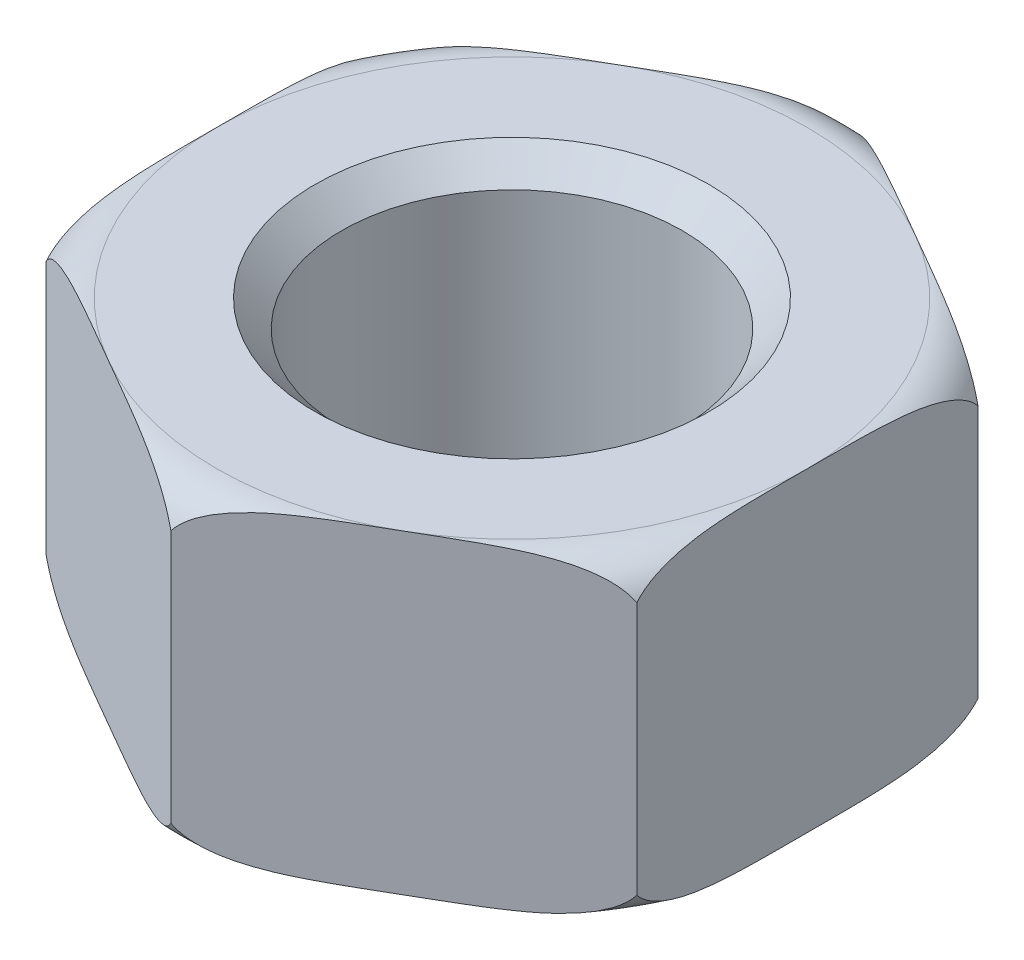
ISO-10303-21;
HEADER;
FILE_DESCRIPTION(('STEP AP214'),'2;1');
FILE_NAME('part.step','',(''),(''),'','','');
FILE_SCHEMA(('AUTOMOTIVE_DESIGN { 1 0 10303 214 1 1 1 1 }'));
ENDSEC;
DATA;
#1=APPLICATION_CONTEXT('core data for automotive mechanical design processes');
#2=APPLICATION_PROTOCOL_DEFINITION('international standard','automotive_design',2000,#1);
#3=PRODUCT_CONTEXT('',#1,'mechanical');
#4=PRODUCT('Part','Part','',(#3));
#5=PRODUCT_RELATED_PRODUCT_CATEGORY('part','',(#4));
#6=PRODUCT_DEFINITION_FORMATION('','',#4);
#7=PRODUCT_DEFINITION_CONTEXT('part definition',#1,'design');
#8=PRODUCT_DEFINITION('design','',#6,#7);
#9=PRODUCT_DEFINITION_SHAPE('','',#8);
#10=(LENGTH_UNIT() NAMED_UNIT(*) SI_UNIT(.MILLI.,.METRE.));
#11=(NAMED_UNIT(*) PLANE_ANGLE_UNIT() SI_UNIT($,.RADIAN.));
#12=(NAMED_UNIT(*) SI_UNIT($,.STERADIAN.) SOLID_ANGLE_UNIT());
#13=UNCERTAINTY_MEASURE_WITH_UNIT(LENGTH_MEASURE(1.E-05),#10,'distance_accuracy_value','');
#14=(GEOMETRIC_REPRESENTATION_CONTEXT(3) GLOBAL_UNCERTAINTY_ASSIGNED_CONTEXT((#13)) GLOBAL_UNIT_ASSIGNED_CONTEXT((#10,
#11,#12)) REPRESENTATION_CONTEXT('',''));
#15=CARTESIAN_POINT('',(0.,0.,0.));
#16=DIRECTION('',(0.,0.,1.));
#17=DIRECTION('',(1.,0.,0.));
#18=AXIS2_PLACEMENT_3D('',#15,#16,#17);
#19=CARTESIAN_POINT('',(0.,99.353,0.));
#20=DIRECTION('',(0.,-1.,0.));
#21=DIRECTION('',(0.,0.,-1.));
#22=AXIS2_PLACEMENT_3D('',#19,#20,#21);
#23=CONICAL_SURFACE('',#22,8.647,0.7853981634);
#24=CARTESIAN_POINT('',(0.,99.353,0.));
#25=DIRECTION('',(0.,-1.,0.));
#26=DIRECTION('',(0.,0.,-1.));
#27=AXIS2_PLACEMENT_3D('',#24,#25,#26);
#28=CIRCLE('',#27,8.647);
#29=CARTESIAN_POINT('',(0.,99.353,-8.647));
#30=VERTEX_POINT('',#29);
#31=EDGE_CURVE('E444',#30,#30,#28,.T.);
#32=ORIENTED_EDGE('',*,*,#31,.F.);
#33=EDGE_LOOP('',(#32));
#34=FACE_BOUND('',#33,.T.);
#35=CARTESIAN_POINT('',(0.,98.,0.));
#36=DIRECTION('',(0.,-1.,0.));
#37=DIRECTION('',(0.,0.,-1.));
#38=AXIS2_PLACEMENT_3D('',#35,#36,#37);
#39=CIRCLE('',#38,10.);
#40=CARTESIAN_POINT('',(0.,98.,-10.));
#41=VERTEX_POINT('',#40);
#42=EDGE_CURVE('E647',#41,#41,#39,.T.);
#43=ORIENTED_EDGE('',*,*,#42,.T.);
#44=EDGE_LOOP('',(#43));
#45=FACE_BOUND('',#44,.T.);
#46=ADVANCED_FACE('F16',(#34,#45),#23,.F.);
#47=CARTESIAN_POINT('',(0.,100.5,0.));
#48=DIRECTION('',(0.,-1.,0.));
#49=DIRECTION('',(0.,0.,-1.));
#50=AXIS2_PLACEMENT_3D('',#47,#48,#49);
#51=TOROIDAL_SURFACE('',#50,15.,2.5);
#52=CARTESIAN_POINT('',(0.,98.,0.));
#53=DIRECTION('',(0.,-1.,0.));
#54=DIRECTION('',(0.,0.,-1.));
#55=AXIS2_PLACEMENT_3D('',#52,#53,#54);
#56=CIRCLE('',#55,15.);
#57=CARTESIAN_POINT('',(15.,98.,0.));
#58=VERTEX_POINT('',#57);
#59=CARTESIAN_POINT('',(7.5,98.,12.9903810567666));
#60=VERTEX_POINT('',#59);
#61=EDGE_CURVE('E642',#58,#60,#56,.T.);
#62=ORIENTED_EDGE('',*,*,#61,.F.);
#63=CARTESIAN_POINT('',(15.,99.5698160017164,8.6602540378445));
#64=CARTESIAN_POINT('',(15.,99.1235587743943,8.30248641245072));
#65=CARTESIAN_POINT('',(15.,98.7969868193529,7.63259410784461));
#66=CARTESIAN_POINT('',(15.,98.5436425127163,7.11291261403682));
#67=CARTESIAN_POINT('',(15.,98.3732258924549,6.41584851672687));
#68=CARTESIAN_POINT('',(15.,98.1765293572079,5.6112902959642));
#69=CARTESIAN_POINT('',(15.,98.0891008871725,4.50357468180948));
#70=CARTESIAN_POINT('',(15.,98.0193801516706,3.62021543607928));
#71=CARTESIAN_POINT('',(15.,98.0056706848194,2.25321956097453));
#72=CARTESIAN_POINT('',(15.,97.9999999999998,1.68778526352565));
#73=CARTESIAN_POINT('',(15.,97.9999999999998,0.));
#74=B_SPLINE_CURVE_WITH_KNOTS('',2,(#63,#64,#65,#66,#67,#68,#69,#70,#71,#72,#73),.UNSPECIFIED.,
.F.,.F.,(3,2,2,2,2,3),(0.,0.142857142857143,0.285714285714286,0.5,0.75,1.),.UNSPECIFIED.);
#75=CARTESIAN_POINT('',(15.,99.5698160017164,8.6602540378445));
#76=VERTEX_POINT('',#75);
#77=EDGE_CURVE('E28',#76,#58,#74,.T.);
#78=ORIENTED_EDGE('',*,*,#77,.F.);
#79=CARTESIAN_POINT('',(7.50000000000001,98.,12.9903810567666));
#80=CARTESIAN_POINT('',(8.96130139296698,98.,12.14669830417));
#81=CARTESIAN_POINT('',(9.45168874238305,98.0056746595264,11.8635730359774));
#82=CARTESIAN_POINT('',(10.6339885104924,98.0193559844018,11.1809719465966));
#83=CARTESIAN_POINT('',(11.3995414098782,98.0890399843953,10.7389797740573));
#84=CARTESIAN_POINT('',(12.7132104172627,98.2086159290171,9.98053261901784));
#85=CARTESIAN_POINT('',(13.580530579708,98.5478938005466,9.47978508975645));
#86=CARTESIAN_POINT('',(14.0128615715186,98.7170128237735,9.23017867525555));
#87=CARTESIAN_POINT('',(14.3513386318172,98.9459349697346,9.03475885337765));
#88=CARTESIAN_POINT('',(14.7576194955756,99.2207148532293,8.80019248732015));
#89=CARTESIAN_POINT('',(14.9999999999954,99.5698160017096,8.66025403784707));
#90=B_SPLINE_CURVE_WITH_KNOTS('',2,(#79,#80,#81,#82,#83,#84,#85,#86,#87,#88,#89),.UNSPECIFIED.,
.F.,.F.,(3,2,2,2,2,3),(0.,0.25,0.5,0.785714285714286,0.892857142857143,1.),.UNSPECIFIED.);
#91=EDGE_CURVE('E274',#60,#76,#90,.T.);
#92=ORIENTED_EDGE('',*,*,#91,.F.);
#93=EDGE_LOOP('',(#62,#78,#92));
#94=FACE_BOUND('',#93,.T.);
#95=ADVANCED_FACE('F329',(#94),#51,.T.);
#96=CARTESIAN_POINT('',(0.,100.5,0.));
#97=DIRECTION('',(0.,-1.,0.));
#98=DIRECTION('',(0.,0.,-1.));
#99=AXIS2_PLACEMENT_3D('',#96,#97,#98);
#100=TOROIDAL_SURFACE('',#99,15.,2.5);
#101=CARTESIAN_POINT('',(0.,98.,0.));
#102=DIRECTION('',(0.,-1.,0.));
#103=DIRECTION('',(0.,0.,-1.));
#104=AXIS2_PLACEMENT_3D('',#101,#102,#103);
#105=CIRCLE('',#104,15.);
#106=CARTESIAN_POINT('',(7.5,98.,-12.9903810567666));
#107=VERTEX_POINT('',#106);
#108=EDGE_CURVE('E638',#107,#58,#105,.T.);
#109=ORIENTED_EDGE('',*,*,#108,.F.);
#110=CARTESIAN_POINT('',(15.,99.5698160017162,-8.66025403784439));
#111=CARTESIAN_POINT('',(14.6901583945827,99.1235504880852,-8.83914117213819));
#112=CARTESIAN_POINT('',(14.1070099075446,98.7951777401203,-9.17582210810721));
#113=CARTESIAN_POINT('',(13.6560550351045,98.5412436324912,-9.43618102510283));
#114=CARTESIAN_POINT('',(13.0496927853532,98.3715958813944,-9.78626443322316));
#115=CARTESIAN_POINT('',(12.3469398749741,98.1749799956406,-10.1919990152044));
#116=CARTESIAN_POINT('',(11.3942245112058,98.088556842543,-10.7420494869371));
#117=CARTESIAN_POINT('',(10.9487787627853,98.0481493634821,-10.999227709697));
#118=CARTESIAN_POINT('',(10.4228436589616,98.0279250351167,-11.3028764834659));
#119=CARTESIAN_POINT('',(10.0125896437003,98.0121491117042,-11.5397367496132));
#120=CARTESIAN_POINT('',(9.44929207325011,98.0056469594591,-11.8649567535464));
#121=CARTESIAN_POINT('',(9.15200076880457,98.0022153215043,-12.0365979681958));
#122=CARTESIAN_POINT('',(8.79968794252099,98.0008530140581,-12.2400058732896));
#123=CARTESIAN_POINT('',(8.57908590843888,98.,-12.3673705170507));
#124=CARTESIAN_POINT('',(7.49999999999998,98.,-12.9903810567666));
#125=B_SPLINE_CURVE_WITH_KNOTS('',2,(#110,#111,#112,#113,#114,#115,#116,#117,#118,#119,#120,
#121,#122,#123,#124),.UNSPECIFIED.,.F.,.F.,(3,2,2,2,2,2,2,3),(0.,0.142857142857143,
0.285714285714286,0.5,0.625,0.75,0.833333333333333,1.),.UNSPECIFIED.);
#126=CARTESIAN_POINT('',(15.,99.5698160017162,-8.66025403784439));
#127=VERTEX_POINT('',#126);
#128=EDGE_CURVE('E590',#127,#107,#125,.T.);
#129=ORIENTED_EDGE('',*,*,#128,.F.);
#130=CARTESIAN_POINT('',(15.,97.9999999999998,0.));
#131=CARTESIAN_POINT('',(15.,97.9999999999998,-1.68868131386039));
#132=CARTESIAN_POINT('',(15.,98.0056922792719,-2.25537113221989));
#133=CARTESIAN_POINT('',(15.,98.0122399374035,-2.90721743489511));
#134=CARTESIAN_POINT('',(15.,98.0281568381506,-3.38252569359753));
#135=CARTESIAN_POINT('',(15.,98.0485310932759,-3.99093884386311));
#136=CARTESIAN_POINT('',(15.,98.0895002561107,-4.50862793481097));
#137=CARTESIAN_POINT('',(15.,98.1449823104225,-5.20970289639727));
#138=CARTESIAN_POINT('',(15.,98.2444066186536,-5.78851901899739));
#139=CARTESIAN_POINT('',(15.,98.3632900476595,-6.48061984064661));
#140=CARTESIAN_POINT('',(15.,98.5522744124461,-7.03388595719446));
#141=CARTESIAN_POINT('',(15.,98.7226635616629,-7.53271316438461));
#142=CARTESIAN_POINT('',(15.,98.9499261318429,-7.91781339707681));
#143=CARTESIAN_POINT('',(15.,99.2248677171825,-8.38370651976381));
#144=CARTESIAN_POINT('',(15.,99.5698160017162,-8.66025403784441));
#145=B_SPLINE_CURVE_WITH_KNOTS('',2,(#130,#131,#132,#133,#134,#135,#136,#137,#138,#139,#140,
#141,#142,#143,#144),.UNSPECIFIED.,.F.,.F.,(3,2,2,2,2,2,2,3),(0.,0.25,0.375,0.5,
0.642857142857143,0.785714285714286,0.892857142857143,1.),.UNSPECIFIED.);
#146=EDGE_CURVE('E11',#58,#127,#145,.T.);
#147=ORIENTED_EDGE('',*,*,#146,.F.);
#148=EDGE_LOOP('',(#109,#129,#147));
#149=FACE_BOUND('',#148,.T.);
#150=ADVANCED_FACE('F294',(#149),#100,.T.);
#151=CARTESIAN_POINT('',(15.,98.,8.66025403784439));
#152=DIRECTION('',(1.,0.,0.));
#153=DIRECTION('',(0.,1.,0.));
#154=AXIS2_PLACEMENT_3D('',#151,#152,#153);
#155=PLANE('',#154);
#156=CARTESIAN_POINT('',(15.,112.430183998289,-8.66025403784011));
#157=CARTESIAN_POINT('',(15.,112.876441225636,-8.30248641242526));
#158=CARTESIAN_POINT('',(15.,113.20301318065,-7.63259410783921));
#159=CARTESIAN_POINT('',(15.,113.456357487343,-7.11291261388786));
#160=CARTESIAN_POINT('',(15.,113.626774107546,-6.41584851672201));
#161=CARTESIAN_POINT('',(15.,113.823470642816,-5.61129029575693));
#162=CARTESIAN_POINT('',(15.,113.910899112828,-4.50357468180603));
#163=CARTESIAN_POINT('',(15.,113.980619848316,-3.62021543618047));
#164=CARTESIAN_POINT('',(15.,113.994329315181,-2.25321956097283));
#165=CARTESIAN_POINT('',(15.,114.,-1.68778526407481));
#166=CARTESIAN_POINT('',(15.,114.,0.));
#167=B_SPLINE_CURVE_WITH_KNOTS('',2,(#156,#157,#158,#159,#160,#161,#162,#163,#164,#165,#166),
.UNSPECIFIED.,.F.,.F.,(3,2,2,2,2,3),(0.,0.142857142857143,0.285714285714286,0.5,0.75,1.),.UNSPECIFIED.);
#168=CARTESIAN_POINT('',(14.9999999999908,112.430183998297,-8.66025403784971));
#169=VERTEX_POINT('',#168);
#170=CARTESIAN_POINT('',(15.,114.,0.));
#171=VERTEX_POINT('',#170);
#172=EDGE_CURVE('E449',#169,#171,#167,.T.);
#173=ORIENTED_EDGE('',*,*,#172,.T.);
#174=CARTESIAN_POINT('',(15.,114.,0.));
#175=CARTESIAN_POINT('',(15.,114.,1.68868131354634));
#176=CARTESIAN_POINT('',(15.,113.994307720728,2.2553711322199));
#177=CARTESIAN_POINT('',(15.,113.9877600626,2.90721743494813));
#178=CARTESIAN_POINT('',(15.,113.971843161849,3.38252569359754));
#179=CARTESIAN_POINT('',(15.,113.951468906711,3.99093884405182));
#180=CARTESIAN_POINT('',(15.,113.910499743889,4.508627934811));
#181=CARTESIAN_POINT('',(15.,113.855017689591,5.20970289619395));
#182=CARTESIAN_POINT('',(15.,113.755593381346,5.78851901899741));
#183=CARTESIAN_POINT('',(15.,113.636709952394,6.48061984047995));
#184=CARTESIAN_POINT('',(15.,113.447725587554,7.03388595719449));
#185=CARTESIAN_POINT('',(15.,113.277336438343,7.53271316437491));
#186=CARTESIAN_POINT('',(15.,113.050073868157,7.9178133970768));
#187=CARTESIAN_POINT('',(15.,112.775132282818,8.3837065197623));
#188=CARTESIAN_POINT('',(15.,112.430183998284,8.66025403784439));
#189=B_SPLINE_CURVE_WITH_KNOTS('',2,(#174,#175,#176,#177,#178,#179,#180,#181,#182,#183,#184,
#185,#186,#187,#188),.UNSPECIFIED.,.F.,.F.,(3,2,2,2,2,2,2,3),(0.,0.25,0.375,0.5,
0.642857142857143,0.785714285714286,0.892857142857143,1.),.UNSPECIFIED.);
#190=CARTESIAN_POINT('',(15.,112.430183998284,8.66025403784439));
#191=VERTEX_POINT('',#190);
#192=EDGE_CURVE('E137',#171,#191,#189,.T.);
#193=ORIENTED_EDGE('',*,*,#192,.T.);
#194=DIRECTION('',(0.,1.,0.));
#195=VECTOR('',#194,1.);
#196=CARTESIAN_POINT('',(15.,98.,8.66025403784439));
#197=LINE('',#196,#195);
#198=EDGE_CURVE('E327',#76,#191,#197,.T.);
#199=ORIENTED_EDGE('',*,*,#198,.F.);
#200=ORIENTED_EDGE('',*,*,#77,.T.);
#201=ORIENTED_EDGE('',*,*,#146,.T.);
#202=DIRECTION('',(0.,1.,0.));
#203=VECTOR('',#202,1.);
#204=CARTESIAN_POINT('',(15.,98.,-8.66025403784439));
#205=LINE('',#204,#203);
#206=EDGE_CURVE('E624',#127,#169,#205,.T.);
#207=ORIENTED_EDGE('',*,*,#206,.T.);
#208=EDGE_LOOP('',(#173,#193,#199,#200,#201,#207));
#209=FACE_BOUND('',#208,.T.);
#210=ADVANCED_FACE('F284',(#209),#155,.T.);
#211=CARTESIAN_POINT('',(-15.,98.,8.66025403784439));
#212=DIRECTION('',(-0.5,0.,0.866025403784439));
#213=DIRECTION('',(0.,1.,0.));
#214=AXIS2_PLACEMENT_3D('',#211,#212,#213);
#215=PLANE('',#214);
#216=DIRECTION('',(0.,1.,0.));
#217=VECTOR('',#216,1.);
#218=CARTESIAN_POINT('',(0.,98.,17.3205080756888));
#219=LINE('',#218,#217);
#220=CARTESIAN_POINT('',(0.,99.5698160017011,17.3205080756827));
#221=VERTEX_POINT('',#220);
#222=CARTESIAN_POINT('',(0.,112.430183998297,17.3205080756834));
#223=VERTEX_POINT('',#222);
#224=EDGE_CURVE('E694',#221,#223,#219,.T.);
#225=ORIENTED_EDGE('',*,*,#224,.T.);
#226=CARTESIAN_POINT('',(-2.43728648374741E-12,112.430183998298,17.3205080756874));
#227=CARTESIAN_POINT('',(-0.309841605470358,112.876449511963,17.1416209413643));
#228=CARTESIAN_POINT('',(-0.892990092455252,113.20482225988,16.8049400054261));
#229=CARTESIAN_POINT('',(-1.34394496492118,113.458756367509,16.5445810884155));
#230=CARTESIAN_POINT('',(-1.95030721464656,113.628404118606,16.1944976803101));
#231=CARTESIAN_POINT('',(-2.65306012499316,113.825020004358,15.7887630983477));
#232=CARTESIAN_POINT('',(-3.60577548879402,113.911443157457,15.2387126265962));
#233=CARTESIAN_POINT('',(-4.05122123721179,113.951850636517,14.9815344038378));
#234=CARTESIAN_POINT('',(-4.57715634103828,113.972074964883,14.6778856300673));
#235=CARTESIAN_POINT('',(-4.98741035668797,113.987850888312,14.4410253636959));
#236=CARTESIAN_POINT('',(-5.55070792674983,113.994353040541,14.1158053599868));
#237=CARTESIAN_POINT('',(-5.84799923200435,113.9977846785,13.9441641448703));
#238=CARTESIAN_POINT('',(-6.20031205747897,113.999146985942,13.7407562402436));
#239=CARTESIAN_POINT('',(-6.42091409158262,114.,13.6133915964701));
#240=CARTESIAN_POINT('',(-7.49999999999998,114.,12.9903810567666));
#241=B_SPLINE_CURVE_WITH_KNOTS('',2,(#226,#227,#228,#229,#230,#231,#232,#233,#234,#235,#236,
#237,#238,#239,#240),.UNSPECIFIED.,.F.,.F.,(3,2,2,2,2,2,2,3),(0.,0.142857142857143,
0.285714285714286,0.5,0.625,0.75,0.833333333333333,1.),.UNSPECIFIED.);
#242=CARTESIAN_POINT('',(-7.5,114.,12.9903810567666));
#243=VERTEX_POINT('',#242);
#244=EDGE_CURVE('E656',#223,#243,#241,.T.);
#245=ORIENTED_EDGE('',*,*,#244,.T.);
#246=CARTESIAN_POINT('',(-7.49999999999998,114.,12.9903810567666));
#247=CARTESIAN_POINT('',(-8.96130139124323,114.,12.1466983051651));
#248=CARTESIAN_POINT('',(-9.45168874238303,113.994325340474,11.8635730359774));
#249=CARTESIAN_POINT('',(-10.6339885096989,113.980644015655,11.1809719470547));
#250=CARTESIAN_POINT('',(-11.3995414098781,113.910960015605,10.7389797740574));
#251=CARTESIAN_POINT('',(-12.7132104170932,113.791384071025,9.98053261911569));
#252=CARTESIAN_POINT('',(-13.5805305797077,113.452106199454,9.47978508975659));
#253=CARTESIAN_POINT('',(-14.0128615714777,113.282987176255,9.23017867527915));
#254=CARTESIAN_POINT('',(-14.3513386318171,113.054065030265,9.03475885337769));
#255=CARTESIAN_POINT('',(-14.7576194955772,112.779285146768,8.80019248731921));
#256=CARTESIAN_POINT('',(-14.9999999999954,112.43018399829,8.66025403784705));
#257=B_SPLINE_CURVE_WITH_KNOTS('',2,(#246,#247,#248,#249,#250,#251,#252,#253,#254,#255,#256),
.UNSPECIFIED.,.F.,.F.,(3,2,2,2,2,3),(0.,0.25,0.5,0.785714285714286,0.892857142857143,1.),.UNSPECIFIED.);
#258=CARTESIAN_POINT('',(-15.,112.430183998284,8.6602540378445));
#259=VERTEX_POINT('',#258);
#260=EDGE_CURVE('E721',#243,#259,#257,.T.);
#261=ORIENTED_EDGE('',*,*,#260,.T.);
#262=DIRECTION('',(0.,1.,0.));
#263=VECTOR('',#262,1.);
#264=CARTESIAN_POINT('',(-15.,98.,8.66025403784439));
#265=LINE('',#264,#263);
#266=CARTESIAN_POINT('',(-15.,99.5698160017162,8.66025403784439));
#267=VERTEX_POINT('',#266);
#268=EDGE_CURVE('E41',#267,#259,#265,.T.);
#269=ORIENTED_EDGE('',*,*,#268,.F.);
#270=CARTESIAN_POINT('',(-15.,99.5698160017162,8.66025403784439));
#271=CARTESIAN_POINT('',(-14.6901583945827,99.1235504880852,8.83914117213819));
#272=CARTESIAN_POINT('',(-14.1070099075446,98.7951777401203,9.17582210810721));
#273=CARTESIAN_POINT('',(-13.6560550351045,98.5412436324912,9.43618102510283));
#274=CARTESIAN_POINT('',(-13.0496927853532,98.3715958813944,9.78626443322316));
#275=CARTESIAN_POINT('',(-12.3469398749741,98.1749799956406,10.1919990152044));
#276=CARTESIAN_POINT('',(-11.3942245112058,98.088556842543,10.7420494869371));
#277=CARTESIAN_POINT('',(-10.9487787627853,98.0481493634821,10.999227709697));
#278=CARTESIAN_POINT('',(-10.4228436589616,98.0279250351167,11.3028764834659));
#279=CARTESIAN_POINT('',(-10.0125896437003,98.0121491117042,11.5397367496132));
#280=CARTESIAN_POINT('',(-9.44929207325011,98.0056469594591,11.8649567535464));
#281=CARTESIAN_POINT('',(-9.15200076880457,98.0022153215043,12.0365979681958));
#282=CARTESIAN_POINT('',(-8.79968794252099,98.0008530140581,12.2400058732896));
#283=CARTESIAN_POINT('',(-8.57908590843888,98.,12.3673705170507));
#284=CARTESIAN_POINT('',(-7.49999999999998,98.,12.9903810567666));
#285=B_SPLINE_CURVE_WITH_KNOTS('',2,(#270,#271,#272,#273,#274,#275,#276,#277,#278,#279,#280,
#281,#282,#283,#284),.UNSPECIFIED.,.F.,.F.,(3,2,2,2,2,2,2,3),(0.,0.142857142857143,
0.285714285714286,0.5,0.625,0.75,0.833333333333333,1.),.UNSPECIFIED.);
#286=CARTESIAN_POINT('',(-7.5,98.,12.9903810567666));
#287=VERTEX_POINT('',#286);
#288=EDGE_CURVE('E763',#267,#287,#285,.T.);
#289=ORIENTED_EDGE('',*,*,#288,.T.);
#290=CARTESIAN_POINT('',(-7.49999999999998,98.,12.9903810567666));
#291=CARTESIAN_POINT('',(-6.0386986094978,98.,13.8340638079402));
#292=CARTESIAN_POINT('',(-5.54831125761696,98.0056746595264,14.1171890775558));
#293=CARTESIAN_POINT('',(-4.36601149039713,98.0193559843226,14.799790166423));
#294=CARTESIAN_POINT('',(-3.60045859012182,98.0890399843953,15.2417823394758));
#295=CARTESIAN_POINT('',(-2.28678958269993,98.2086159290174,16.0002294945369));
#296=CARTESIAN_POINT('',(-1.41946942029201,98.5478938005466,16.5009770237767));
#297=CARTESIAN_POINT('',(-0.987138428419907,98.7170128238047,16.7505834383131));
#298=CARTESIAN_POINT('',(-0.648661368182686,98.9459349697346,16.9460032601556));
#299=CARTESIAN_POINT('',(-0.242380504409223,99.2207148532521,17.1805696262218));
#300=CARTESIAN_POINT('',(-1.13971332371676E-12,99.5698160017095,17.3205080756881));
#301=B_SPLINE_CURVE_WITH_KNOTS('',2,(#290,#291,#292,#293,#294,#295,#296,#297,#298,#299,#300),
.UNSPECIFIED.,.F.,.F.,(3,2,2,2,2,3),(0.,0.25,0.5,0.785714285714286,0.892857142857143,1.),.UNSPECIFIED.);
#302=EDGE_CURVE('E756',#287,#221,#301,.T.);
#303=ORIENTED_EDGE('',*,*,#302,.T.);
#304=EDGE_LOOP('',(#225,#245,#261,#269,#289,#303));
#305=FACE_BOUND('',#304,.T.);
#306=ADVANCED_FACE('F216',(#305),#215,.T.);
#307=CARTESIAN_POINT('',(0.,111.5,0.));
#308=DIRECTION('',(0.,-1.,0.));
#309=DIRECTION('',(0.,0.,-1.));
#310=AXIS2_PLACEMENT_3D('',#307,#308,#309);
#311=TOROIDAL_SURFACE('',#310,15.,2.5);
#312=CARTESIAN_POINT('',(7.50000000000001,114.,12.9903810567666));
#313=CARTESIAN_POINT('',(6.03869860939971,114.,13.8340638079969));
#314=CARTESIAN_POINT('',(5.5483112576169,113.994325340474,14.1171890775559));
#315=CARTESIAN_POINT('',(4.36601149001812,113.98064401567,14.7997901666418));
#316=CARTESIAN_POINT('',(3.60045859012163,113.910960015605,15.241782339476));
#317=CARTESIAN_POINT('',(2.28678958258453,113.791384070926,16.0002294946036));
#318=CARTESIAN_POINT('',(1.419469420292,113.452106199453,16.5009770237768));
#319=CARTESIAN_POINT('',(0.987138428454884,113.282987176215,16.7505834382929));
#320=CARTESIAN_POINT('',(0.648661368182735,113.054065030265,16.9460032601556));
#321=CARTESIAN_POINT('',(0.242380504416437,112.779285146758,17.1805696262177));
#322=CARTESIAN_POINT('',(1.17067865106593E-12,112.43018399829,17.3205080756881));
#323=B_SPLINE_CURVE_WITH_KNOTS('',2,(#312,#313,#314,#315,#316,#317,#318,#319,#320,#321,#322),
.UNSPECIFIED.,.F.,.F.,(3,2,2,2,2,3),(0.,0.25,0.5,0.785714285714286,0.892857142857143,1.),.UNSPECIFIED.);
#324=CARTESIAN_POINT('',(7.5,114.,12.9903810567666));
#325=VERTEX_POINT('',#324);
#326=EDGE_CURVE('E391',#325,#223,#323,.T.);
#327=ORIENTED_EDGE('',*,*,#326,.F.);
#328=CARTESIAN_POINT('',(0.,114.,0.));
#329=DIRECTION('',(0.,-1.,0.));
#330=DIRECTION('',(0.,0.,-1.));
#331=AXIS2_PLACEMENT_3D('',#328,#329,#330);
#332=CIRCLE('',#331,15.);
#333=EDGE_CURVE('E508',#325,#243,#332,.T.);
#334=ORIENTED_EDGE('',*,*,#333,.T.);
#335=ORIENTED_EDGE('',*,*,#244,.F.);
#336=EDGE_LOOP('',(#327,#334,#335));
#337=FACE_BOUND('',#336,.T.);
#338=ADVANCED_FACE('F213',(#337),#311,.T.);
#339=CARTESIAN_POINT('',(-15.,98.,-8.66025403784439));
#340=DIRECTION('',(-1.,0.,0.));
#341=DIRECTION('',(0.,0.,1.));
#342=AXIS2_PLACEMENT_3D('',#339,#340,#341);
#343=PLANE('',#342);
#344=CARTESIAN_POINT('',(-15.,112.430183998284,8.66025403784451));
#345=CARTESIAN_POINT('',(-15.,112.876441225621,8.30248641243866));
#346=CARTESIAN_POINT('',(-15.,113.203013180647,7.63259410784461));
#347=CARTESIAN_POINT('',(-15.,113.456357487352,7.11291261388276));
#348=CARTESIAN_POINT('',(-15.,113.626774107545,6.41584851672686));
#349=CARTESIAN_POINT('',(-15.,113.823470642774,5.61129029589633));
#350=CARTESIAN_POINT('',(-15.,113.910899112828,4.50357468180951));
#351=CARTESIAN_POINT('',(-15.,113.980619848309,3.62021543657369));
#352=CARTESIAN_POINT('',(-15.,113.994329315181,2.25321956097459));
#353=CARTESIAN_POINT('',(-15.,114.,1.68778526419175));
#354=CARTESIAN_POINT('',(-15.,114.,0.));
#355=B_SPLINE_CURVE_WITH_KNOTS('',2,(#344,#345,#346,#347,#348,#349,#350,#351,#352,#353,#354),
.UNSPECIFIED.,.F.,.F.,(3,2,2,2,2,3),(0.,0.142857142857143,0.285714285714286,0.5,0.75,1.),.UNSPECIFIED.);
#356=CARTESIAN_POINT('',(-15.,114.,0.));
#357=VERTEX_POINT('',#356);
#358=EDGE_CURVE('E146',#259,#357,#355,.T.);
#359=ORIENTED_EDGE('',*,*,#358,.T.);
#360=CARTESIAN_POINT('',(-15.,114.,0.));
#361=CARTESIAN_POINT('',(-15.,114.,-1.68868131354634));
#362=CARTESIAN_POINT('',(-15.,113.994307720728,-2.2553711322199));
#363=CARTESIAN_POINT('',(-15.,113.9877600626,-2.90721743494813));
#364=CARTESIAN_POINT('',(-15.,113.971843161849,-3.38252569359754));
#365=CARTESIAN_POINT('',(-15.,113.951468906711,-3.99093884405182));
#366=CARTESIAN_POINT('',(-15.,113.910499743889,-4.508627934811));
#367=CARTESIAN_POINT('',(-15.,113.855017689591,-5.20970289619395));
#368=CARTESIAN_POINT('',(-15.,113.755593381346,-5.78851901899741));
#369=CARTESIAN_POINT('',(-15.,113.636709952394,-6.48061984047995));
#370=CARTESIAN_POINT('',(-15.,113.447725587554,-7.03388595719449));
#371=CARTESIAN_POINT('',(-15.,113.277336438343,-7.53271316437491));
#372=CARTESIAN_POINT('',(-15.,113.050073868157,-7.9178133970768));
#373=CARTESIAN_POINT('',(-15.,112.775132282818,-8.3837065197623));
#374=CARTESIAN_POINT('',(-15.,112.430183998284,-8.66025403784439));
#375=B_SPLINE_CURVE_WITH_KNOTS('',2,(#360,#361,#362,#363,#364,#365,#366,#367,#368,#369,#370,
#371,#372,#373,#374),.UNSPECIFIED.,.F.,.F.,(3,2,2,2,2,2,2,3),(0.,0.25,0.375,0.5,
0.642857142857143,0.785714285714286,0.892857142857143,1.),.UNSPECIFIED.);
#376=CARTESIAN_POINT('',(-15.,112.430183998284,-8.66025403784439));
#377=VERTEX_POINT('',#376);
#378=EDGE_CURVE('E518',#357,#377,#375,.T.);
#379=ORIENTED_EDGE('',*,*,#378,.T.);
#380=DIRECTION('',(0.,1.,0.));
#381=VECTOR('',#380,1.);
#382=CARTESIAN_POINT('',(-15.,98.,-8.66025403784439));
#383=LINE('',#382,#381);
#384=CARTESIAN_POINT('',(-15.,99.5698160017029,-8.66025403784439));
#385=VERTEX_POINT('',#384);
#386=EDGE_CURVE('E266',#385,#377,#383,.T.);
#387=ORIENTED_EDGE('',*,*,#386,.F.);
#388=CARTESIAN_POINT('',(-15.,99.5698160017082,-8.66025403783798));
#389=CARTESIAN_POINT('',(-15.,99.1235587743769,-8.30248641243266));
#390=CARTESIAN_POINT('',(-15.,98.796986819349,-7.63259410783657));
#391=CARTESIAN_POINT('',(-15.,98.5436425126597,-7.11291261390711));
#392=CARTESIAN_POINT('',(-15.,98.3732258924531,-6.41584851671968));
#393=CARTESIAN_POINT('',(-15.,98.1765293571752,-5.61129029571337));
#394=CARTESIAN_POINT('',(-15.,98.0891008871722,-4.50357468180434));
#395=CARTESIAN_POINT('',(-15.,98.0193801516873,-3.62021543615927));
#396=CARTESIAN_POINT('',(-15.,98.0056706848194,-2.25321956097197));
#397=CARTESIAN_POINT('',(-15.,97.9999999999998,-1.68778526418426));
#398=CARTESIAN_POINT('',(-15.,97.9999999999998,0.));
#399=B_SPLINE_CURVE_WITH_KNOTS('',2,(#388,#389,#390,#391,#392,#393,#394,#395,#396,#397,#398),
.UNSPECIFIED.,.F.,.F.,(3,2,2,2,2,3),(0.,0.142857142857143,0.285714285714286,0.5,0.75,1.),.UNSPECIFIED.);
#400=CARTESIAN_POINT('',(-15.,98.,0.));
#401=VERTEX_POINT('',#400);
#402=EDGE_CURVE('E549',#385,#401,#399,.T.);
#403=ORIENTED_EDGE('',*,*,#402,.T.);
#404=CARTESIAN_POINT('',(-15.,97.9999999999998,0.));
#405=CARTESIAN_POINT('',(-15.,97.9999999999998,1.68868131457895));
#406=CARTESIAN_POINT('',(-15.,98.0056922792719,2.25537113221989));
#407=CARTESIAN_POINT('',(-15.,98.0122399374231,2.90721743601945));
#408=CARTESIAN_POINT('',(-15.,98.0281568381506,3.38252569359753));
#409=CARTESIAN_POINT('',(-15.,98.0485310933162,3.99093884437157));
#410=CARTESIAN_POINT('',(-15.,98.0895002561107,4.50862793481097));
#411=CARTESIAN_POINT('',(-15.,98.1449823104225,5.20970289639727));
#412=CARTESIAN_POINT('',(-15.,98.2444066186536,5.78851901899739));
#413=CARTESIAN_POINT('',(-15.,98.3632900476595,6.48061984064661));
#414=CARTESIAN_POINT('',(-15.,98.5522744124461,7.03388595719446));
#415=CARTESIAN_POINT('',(-15.,98.7226635616629,7.53271316438461));
#416=CARTESIAN_POINT('',(-15.,98.9499261318429,7.91781339707681));
#417=CARTESIAN_POINT('',(-15.,99.2248677171825,8.38370651976381));
#418=CARTESIAN_POINT('',(-15.,99.5698160017162,8.66025403784441));
#419=B_SPLINE_CURVE_WITH_KNOTS('',2,(#404,#405,#406,#407,#408,#409,#410,#411,#412,#413,#414,
#415,#416,#417,#418),.UNSPECIFIED.,.F.,.F.,(3,2,2,2,2,2,2,3),(0.,0.25,0.375,0.5,
0.642857142857143,0.785714285714286,0.892857142857143,1.),.UNSPECIFIED.);
#420=EDGE_CURVE('E633',#401,#267,#419,.T.);
#421=ORIENTED_EDGE('',*,*,#420,.T.);
#422=ORIENTED_EDGE('',*,*,#268,.T.);
#423=EDGE_LOOP('',(#359,#379,#387,#403,#421,#422));
#424=FACE_BOUND('',#423,.T.);
#425=ADVANCED_FACE('F521',(#424),#343,.T.);
#426=CARTESIAN_POINT('',(0.,111.5,0.));
#427=DIRECTION('',(0.,-1.,0.));
#428=DIRECTION('',(0.,0.,-1.));
#429=AXIS2_PLACEMENT_3D('',#426,#427,#428);
#430=TOROIDAL_SURFACE('',#429,15.,2.5);
#431=CARTESIAN_POINT('',(-7.50000000000001,114.,-12.9903810567666));
#432=CARTESIAN_POINT('',(-6.03869860939971,114.,-13.8340638079969));
#433=CARTESIAN_POINT('',(-5.5483112576169,113.994325340474,-14.1171890775559));
#434=CARTESIAN_POINT('',(-4.36601149001812,113.98064401567,-14.7997901666418));
#435=CARTESIAN_POINT('',(-3.60045859012163,113.910960015605,-15.241782339476));
#436=CARTESIAN_POINT('',(-2.28678958258453,113.791384070926,-16.0002294946036));
#437=CARTESIAN_POINT('',(-1.419469420292,113.452106199453,-16.5009770237768));
#438=CARTESIAN_POINT('',(-0.987138428454884,113.282987176215,-16.7505834382929));
#439=CARTESIAN_POINT('',(-0.648661368182735,113.054065030265,-16.9460032601556));
#440=CARTESIAN_POINT('',(-0.242380504416437,112.779285146758,-17.1805696262177));
#441=CARTESIAN_POINT('',(-1.17067865106593E-12,112.43018399829,-17.3205080756881));
#442=B_SPLINE_CURVE_WITH_KNOTS('',2,(#431,#432,#433,#434,#435,#436,#437,#438,#439,#440,#441),
.UNSPECIFIED.,.F.,.F.,(3,2,2,2,2,3),(0.,0.25,0.5,0.785714285714286,0.892857142857143,1.),.UNSPECIFIED.);
#443=CARTESIAN_POINT('',(-7.5,114.,-12.9903810567666));
#444=VERTEX_POINT('',#443);
#445=CARTESIAN_POINT('',(0.,112.430183998297,-17.3205080756888));
#446=VERTEX_POINT('',#445);
#447=EDGE_CURVE('E160',#444,#446,#442,.T.);
#448=ORIENTED_EDGE('',*,*,#447,.F.);
#449=CARTESIAN_POINT('',(0.,114.,0.));
#450=DIRECTION('',(0.,-1.,0.));
#451=DIRECTION('',(0.,0.,-1.));
#452=AXIS2_PLACEMENT_3D('',#449,#450,#451);
#453=CIRCLE('',#452,15.);
#454=CARTESIAN_POINT('',(7.5,114.,-12.9903810567666));
#455=VERTEX_POINT('',#454);
#456=EDGE_CURVE('E164',#444,#455,#453,.T.);
#457=ORIENTED_EDGE('',*,*,#456,.T.);
#458=CARTESIAN_POINT('',(2.43728648374741E-12,112.430183998298,-17.3205080756874));
#459=CARTESIAN_POINT('',(0.309841605470358,112.876449511963,-17.1416209413643));
#460=CARTESIAN_POINT('',(0.892990092455252,113.20482225988,-16.8049400054261));
#461=CARTESIAN_POINT('',(1.34394496492118,113.458756367509,-16.5445810884155));
#462=CARTESIAN_POINT('',(1.95030721464656,113.628404118606,-16.1944976803101));
#463=CARTESIAN_POINT('',(2.65306012499316,113.825020004358,-15.7887630983477));
#464=CARTESIAN_POINT('',(3.60577548879402,113.911443157457,-15.2387126265962));
#465=CARTESIAN_POINT('',(4.05122123721179,113.951850636517,-14.9815344038378));
#466=CARTESIAN_POINT('',(4.57715634103828,113.972074964883,-14.6778856300673));
#467=CARTESIAN_POINT('',(4.98741035668797,113.987850888312,-14.4410253636959));
#468=CARTESIAN_POINT('',(5.55070792674983,113.994353040541,-14.1158053599868));
#469=CARTESIAN_POINT('',(5.84799923200435,113.9977846785,-13.9441641448703));
#470=CARTESIAN_POINT('',(6.20031205747897,113.999146985942,-13.7407562402436));
#471=CARTESIAN_POINT('',(6.42091409158262,114.,-13.6133915964701));
#472=CARTESIAN_POINT('',(7.49999999999998,114.,-12.9903810567666));
#473=B_SPLINE_CURVE_WITH_KNOTS('',2,(#458,#459,#460,#461,#462,#463,#464,#465,#466,#467,#468,
#469,#470,#471,#472),.UNSPECIFIED.,.F.,.F.,(3,2,2,2,2,2,2,3),(0.,0.142857142857143,
0.285714285714286,0.5,0.625,0.75,0.833333333333333,1.),.UNSPECIFIED.);
#474=EDGE_CURVE('E155',#446,#455,#473,.T.);
#475=ORIENTED_EDGE('',*,*,#474,.F.);
#476=EDGE_LOOP('',(#448,#457,#475));
#477=FACE_BOUND('',#476,.T.);
#478=ADVANCED_FACE('F158',(#477),#430,.T.);
#479=CARTESIAN_POINT('',(0.,111.5,0.));
#480=DIRECTION('',(0.,-1.,0.));
#481=DIRECTION('',(0.,0.,-1.));
#482=AXIS2_PLACEMENT_3D('',#479,#480,#481);
#483=TOROIDAL_SURFACE('',#482,15.,2.5);
#484=CARTESIAN_POINT('',(0.,114.,0.));
#485=DIRECTION('',(0.,-1.,0.));
#486=DIRECTION('',(0.,0.,-1.));
#487=AXIS2_PLACEMENT_3D('',#484,#485,#486);
#488=CIRCLE('',#487,15.);
#489=EDGE_CURVE('E502',#243,#357,#488,.T.);
#490=ORIENTED_EDGE('',*,*,#489,.T.);
#491=ORIENTED_EDGE('',*,*,#358,.F.);
#492=ORIENTED_EDGE('',*,*,#260,.F.);
#493=EDGE_LOOP('',(#490,#491,#492));
#494=FACE_BOUND('',#493,.T.);
#495=ADVANCED_FACE('F255',(#494),#483,.T.);
#496=CARTESIAN_POINT('',(0.,111.5,0.));
#497=DIRECTION('',(0.,-1.,0.));
#498=DIRECTION('',(0.,0.,-1.));
#499=AXIS2_PLACEMENT_3D('',#496,#497,#498);
#500=TOROIDAL_SURFACE('',#499,15.,2.5);
#501=CARTESIAN_POINT('',(0.,114.,0.));
#502=DIRECTION('',(0.,-1.,0.));
#503=DIRECTION('',(0.,0.,-1.));
#504=AXIS2_PLACEMENT_3D('',#501,#502,#503);
#505=CIRCLE('',#504,15.);
#506=EDGE_CURVE('E489',#357,#444,#505,.T.);
#507=ORIENTED_EDGE('',*,*,#506,.T.);
#508=CARTESIAN_POINT('',(-15.,112.430183998284,-8.6602540378444));
#509=CARTESIAN_POINT('',(-14.6901583945755,112.876449511924,-8.8391411721424));
#510=CARTESIAN_POINT('',(-14.1070099075417,113.204822259881,-9.1758221081089));
#511=CARTESIAN_POINT('',(-13.6560550351352,113.458756367488,-9.43618102508512));
#512=CARTESIAN_POINT('',(-13.0496927853506,113.628404118607,-9.7862644332247));
#513=CARTESIAN_POINT('',(-12.3469398751951,113.825020004313,-10.1919990150768));
#514=CARTESIAN_POINT('',(-11.3942245112038,113.911443157457,-10.7420494869382));
#515=CARTESIAN_POINT('',(-10.9487787636774,113.95185063645,-10.999227709182));
#516=CARTESIAN_POINT('',(-10.4228436589601,113.972074964884,-11.3028764834668));
#517=CARTESIAN_POINT('',(-10.0125896445175,113.987850888291,-11.5397367491414));
#518=CARTESIAN_POINT('',(-9.44929207324909,113.994353040541,-11.864956753547));
#519=CARTESIAN_POINT('',(-9.1520007690787,113.997784678491,-12.0365979680376));
#520=CARTESIAN_POINT('',(-8.79968794252032,113.999146985942,-12.24000587329));
#521=CARTESIAN_POINT('',(-8.57908590922268,114.,-12.3673705165982));
#522=CARTESIAN_POINT('',(-7.50000000000001,114.,-12.9903810567666));
#523=B_SPLINE_CURVE_WITH_KNOTS('',2,(#508,#509,#510,#511,#512,#513,#514,#515,#516,#517,#518,
#519,#520,#521,#522),.UNSPECIFIED.,.F.,.F.,(3,2,2,2,2,2,2,3),(0.,0.142857142857143,
0.285714285714286,0.5,0.625,0.75,0.833333333333333,1.),.UNSPECIFIED.);
#524=EDGE_CURVE('E190',#377,#444,#523,.T.);
#525=ORIENTED_EDGE('',*,*,#524,.F.);
#526=ORIENTED_EDGE('',*,*,#378,.F.);
#527=EDGE_LOOP('',(#507,#525,#526));
#528=FACE_BOUND('',#527,.T.);
#529=ADVANCED_FACE('F244',(#528),#500,.T.);
#530=CARTESIAN_POINT('',(0.,111.5,0.));
#531=DIRECTION('',(0.,-1.,0.));
#532=DIRECTION('',(0.,0.,-1.));
#533=AXIS2_PLACEMENT_3D('',#530,#531,#532);
#534=TOROIDAL_SURFACE('',#533,15.,2.5);
#535=ORIENTED_EDGE('',*,*,#192,.F.);
#536=CARTESIAN_POINT('',(0.,114.,0.));
#537=DIRECTION('',(0.,-1.,0.));
#538=DIRECTION('',(0.,0.,-1.));
#539=AXIS2_PLACEMENT_3D('',#536,#537,#538);
#540=CIRCLE('',#539,15.);
#541=EDGE_CURVE('E439',#171,#325,#540,.T.);
#542=ORIENTED_EDGE('',*,*,#541,.T.);
#543=CARTESIAN_POINT('',(15.,112.430183998284,8.6602540378444));
#544=CARTESIAN_POINT('',(14.6901583945755,112.876449511924,8.8391411721424));
#545=CARTESIAN_POINT('',(14.1070099075417,113.204822259881,9.1758221081089));
#546=CARTESIAN_POINT('',(13.6560550351352,113.458756367488,9.43618102508512));
#547=CARTESIAN_POINT('',(13.0496927853506,113.628404118607,9.7862644332247));
#548=CARTESIAN_POINT('',(12.3469398751951,113.825020004313,10.1919990150768));
#549=CARTESIAN_POINT('',(11.3942245112038,113.911443157457,10.7420494869382));
#550=CARTESIAN_POINT('',(10.9487787636774,113.95185063645,10.999227709182));
#551=CARTESIAN_POINT('',(10.4228436589601,113.972074964884,11.3028764834668));
#552=CARTESIAN_POINT('',(10.0125896445175,113.987850888291,11.5397367491414));
#553=CARTESIAN_POINT('',(9.44929207324909,113.994353040541,11.864956753547));
#554=CARTESIAN_POINT('',(9.1520007690787,113.997784678491,12.0365979680376));
#555=CARTESIAN_POINT('',(8.79968794252032,113.999146985942,12.24000587329));
#556=CARTESIAN_POINT('',(8.57908590922268,114.,12.3673705165982));
#557=CARTESIAN_POINT('',(7.50000000000001,114.,12.9903810567666));
#558=B_SPLINE_CURVE_WITH_KNOTS('',2,(#543,#544,#545,#546,#547,#548,#549,#550,#551,#552,#553,
#554,#555,#556,#557),.UNSPECIFIED.,.F.,.F.,(3,2,2,2,2,2,2,3),(0.,0.142857142857143,
0.285714285714286,0.5,0.625,0.75,0.833333333333333,1.),.UNSPECIFIED.);
#559=EDGE_CURVE('E402',#191,#325,#558,.T.);
#560=ORIENTED_EDGE('',*,*,#559,.F.);
#561=EDGE_LOOP('',(#535,#542,#560));
#562=FACE_BOUND('',#561,.T.);
#563=ADVANCED_FACE('F254',(#562),#534,.T.);
#564=CARTESIAN_POINT('',(0.,111.5,0.));
#565=DIRECTION('',(0.,-1.,0.));
#566=DIRECTION('',(0.,0.,-1.));
#567=AXIS2_PLACEMENT_3D('',#564,#565,#566);
#568=TOROIDAL_SURFACE('',#567,15.,2.5);
#569=CARTESIAN_POINT('',(7.49999999999998,114.,-12.9903810567666));
#570=CARTESIAN_POINT('',(8.96130139124323,114.,-12.1466983051651));
#571=CARTESIAN_POINT('',(9.45168874238303,113.994325340474,-11.8635730359774));
#572=CARTESIAN_POINT('',(10.6339885096989,113.980644015655,-11.1809719470547));
#573=CARTESIAN_POINT('',(11.3995414098781,113.910960015605,-10.7389797740574));
#574=CARTESIAN_POINT('',(12.7132104170932,113.791384071025,-9.98053261911569));
#575=CARTESIAN_POINT('',(13.5805305797077,113.452106199454,-9.47978508975659));
#576=CARTESIAN_POINT('',(14.0128615714777,113.282987176255,-9.23017867527915));
#577=CARTESIAN_POINT('',(14.3513386318171,113.054065030265,-9.03475885337769));
#578=CARTESIAN_POINT('',(14.7576194955772,112.779285146768,-8.80019248731921));
#579=CARTESIAN_POINT('',(14.9999999999954,112.43018399829,-8.66025403784705));
#580=B_SPLINE_CURVE_WITH_KNOTS('',2,(#569,#570,#571,#572,#573,#574,#575,#576,#577,#578,#579),
.UNSPECIFIED.,.F.,.F.,(3,2,2,2,2,3),(0.,0.25,0.5,0.785714285714286,0.892857142857143,1.),.UNSPECIFIED.);
#581=EDGE_CURVE('E170',#455,#169,#580,.T.);
#582=ORIENTED_EDGE('',*,*,#581,.F.);
#583=CARTESIAN_POINT('',(0.,114.,0.));
#584=DIRECTION('',(0.,-1.,0.));
#585=DIRECTION('',(0.,0.,-1.));
#586=AXIS2_PLACEMENT_3D('',#583,#584,#585);
#587=CIRCLE('',#586,15.);
#588=EDGE_CURVE('E430',#455,#171,#587,.T.);
#589=ORIENTED_EDGE('',*,*,#588,.T.);
#590=ORIENTED_EDGE('',*,*,#172,.F.);
#591=EDGE_LOOP('',(#582,#589,#590));
#592=FACE_BOUND('',#591,.T.);
#593=ADVANCED_FACE('F423',(#592),#568,.T.);
#594=CARTESIAN_POINT('',(0.,114.,0.));
#595=DIRECTION('',(0.,1.,0.));
#596=DIRECTION('',(1.,0.,0.));
#597=AXIS2_PLACEMENT_3D('',#594,#595,#596);
#598=PLANE('',#597);
#599=CARTESIAN_POINT('',(0.,114.,0.));
#600=DIRECTION('',(0.,-1.,0.));
#601=DIRECTION('',(0.,0.,-1.));
#602=AXIS2_PLACEMENT_3D('',#599,#600,#601);
#603=CIRCLE('',#602,10.);
#604=CARTESIAN_POINT('',(0.,114.,-10.));
#605=VERTEX_POINT('',#604);
#606=EDGE_CURVE('E821',#605,#605,#603,.T.);
#607=ORIENTED_EDGE('',*,*,#606,.T.);
#608=EDGE_LOOP('',(#607));
#609=FACE_BOUND('',#608,.T.);
#610=ORIENTED_EDGE('',*,*,#541,.F.);
#611=ORIENTED_EDGE('',*,*,#588,.F.);
#612=ORIENTED_EDGE('',*,*,#456,.F.);
#613=ORIENTED_EDGE('',*,*,#506,.F.);
#614=ORIENTED_EDGE('',*,*,#489,.F.);
#615=ORIENTED_EDGE('',*,*,#333,.F.);
#616=EDGE_LOOP('',(#610,#611,#612,#613,#614,#615));
#617=FACE_BOUND('',#616,.T.);
#618=ADVANCED_FACE('F297',(#609,#617),#598,.T.);
#619=CARTESIAN_POINT('',(0.,98.,0.));
#620=DIRECTION('',(0.,1.,0.));
#621=DIRECTION('',(0.,0.,-1.));
#622=AXIS2_PLACEMENT_3D('',#619,#620,#621);
#623=CYLINDRICAL_SURFACE('',#622,8.647);
#624=ORIENTED_EDGE('',*,*,#31,.T.);
#625=EDGE_LOOP('',(#624));
#626=FACE_BOUND('',#625,.T.);
#627=CARTESIAN_POINT('',(0.,112.647,0.));
#628=DIRECTION('',(0.,-1.,0.));
#629=DIRECTION('',(0.,0.,-1.));
#630=AXIS2_PLACEMENT_3D('',#627,#628,#629);
#631=CIRCLE('',#630,8.647);
#632=CARTESIAN_POINT('',(0.,112.647,-8.647));
#633=VERTEX_POINT('',#632);
#634=EDGE_CURVE('E824',#633,#633,#631,.T.);
#635=ORIENTED_EDGE('',*,*,#634,.F.);
#636=EDGE_LOOP('',(#635));
#637=FACE_BOUND('',#636,.T.);
#638=ADVANCED_FACE('F473',(#626,#637),#623,.F.);
#639=CARTESIAN_POINT('',(0.,114.,0.));
#640=DIRECTION('',(0.,1.,0.));
#641=DIRECTION('',(0.,0.,1.));
#642=AXIS2_PLACEMENT_3D('',#639,#640,#641);
#643=CONICAL_SURFACE('',#642,10.,0.7853981634);
#644=ORIENTED_EDGE('',*,*,#634,.T.);
#645=EDGE_LOOP('',(#644));
#646=FACE_BOUND('',#645,.T.);
#647=ORIENTED_EDGE('',*,*,#606,.F.);
#648=EDGE_LOOP('',(#647));
#649=FACE_BOUND('',#648,.T.);
#650=ADVANCED_FACE('F258',(#646,#649),#643,.F.);
#651=CARTESIAN_POINT('',(0.,98.,0.));
#652=DIRECTION('',(0.,1.,0.));
#653=DIRECTION('',(1.,0.,0.));
#654=AXIS2_PLACEMENT_3D('',#651,#652,#653);
#655=PLANE('',#654);
#656=ORIENTED_EDGE('',*,*,#42,.F.);
#657=EDGE_LOOP('',(#656));
#658=FACE_BOUND('',#657,.T.);
#659=CARTESIAN_POINT('',(0.,98.,0.));
#660=DIRECTION('',(0.,-1.,0.));
#661=DIRECTION('',(0.,0.,-1.));
#662=AXIS2_PLACEMENT_3D('',#659,#660,#661);
#663=CIRCLE('',#662,15.);
#664=CARTESIAN_POINT('',(-7.5,98.,-12.9903810567666));
#665=VERTEX_POINT('',#664);
#666=EDGE_CURVE('E605',#665,#107,#663,.T.);
#667=ORIENTED_EDGE('',*,*,#666,.T.);
#668=ORIENTED_EDGE('',*,*,#108,.T.);
#669=ORIENTED_EDGE('',*,*,#61,.T.);
#670=CARTESIAN_POINT('',(0.,98.,0.));
#671=DIRECTION('',(0.,-1.,0.));
#672=DIRECTION('',(0.,0.,-1.));
#673=AXIS2_PLACEMENT_3D('',#670,#671,#672);
#674=CIRCLE('',#673,15.);
#675=EDGE_CURVE('E759',#60,#287,#674,.T.);
#676=ORIENTED_EDGE('',*,*,#675,.T.);
#677=CARTESIAN_POINT('',(0.,98.,0.));
#678=DIRECTION('',(0.,-1.,0.));
#679=DIRECTION('',(0.,0.,-1.));
#680=AXIS2_PLACEMENT_3D('',#677,#678,#679);
#681=CIRCLE('',#680,15.);
#682=EDGE_CURVE('E766',#287,#401,#681,.T.);
#683=ORIENTED_EDGE('',*,*,#682,.T.);
#684=CARTESIAN_POINT('',(0.,98.,0.));
#685=DIRECTION('',(0.,-1.,0.));
#686=DIRECTION('',(0.,0.,-1.));
#687=AXIS2_PLACEMENT_3D('',#684,#685,#686);
#688=CIRCLE('',#687,15.);
#689=EDGE_CURVE('E554',#401,#665,#688,.T.);
#690=ORIENTED_EDGE('',*,*,#689,.T.);
#691=EDGE_LOOP('',(#667,#668,#669,#676,#683,#690));
#692=FACE_BOUND('',#691,.T.);
#693=ADVANCED_FACE('F564',(#658,#692),#655,.F.);
#694=CARTESIAN_POINT('',(0.,100.5,0.));
#695=DIRECTION('',(0.,-1.,0.));
#696=DIRECTION('',(0.,0.,-1.));
#697=AXIS2_PLACEMENT_3D('',#694,#695,#696);
#698=TOROIDAL_SURFACE('',#697,15.,2.5);
#699=CARTESIAN_POINT('',(-7.50000000000001,98.,-12.9903810567666));
#700=CARTESIAN_POINT('',(-8.96130139296698,98.,-12.14669830417));
#701=CARTESIAN_POINT('',(-9.45168874238305,98.0056746595264,-11.8635730359774));
#702=CARTESIAN_POINT('',(-10.6339885104924,98.0193559844018,-11.1809719465966));
#703=CARTESIAN_POINT('',(-11.3995414098782,98.0890399843953,-10.7389797740573));
#704=CARTESIAN_POINT('',(-12.7132104172627,98.2086159290171,-9.98053261901784));
#705=CARTESIAN_POINT('',(-13.580530579708,98.5478938005466,-9.47978508975645));
#706=CARTESIAN_POINT('',(-14.0128615715186,98.7170128237735,-9.23017867525555));
#707=CARTESIAN_POINT('',(-14.3513386318172,98.9459349697346,-9.03475885337765));
#708=CARTESIAN_POINT('',(-14.7576194955756,99.2207148532293,-8.80019248732015));
#709=CARTESIAN_POINT('',(-14.9999999999954,99.5698160017096,-8.66025403784707));
#710=B_SPLINE_CURVE_WITH_KNOTS('',2,(#699,#700,#701,#702,#703,#704,#705,#706,#707,#708,#709),
.UNSPECIFIED.,.F.,.F.,(3,2,2,2,2,3),(0.,0.25,0.5,0.785714285714286,0.892857142857143,1.),.UNSPECIFIED.);
#711=EDGE_CURVE('E171',#665,#385,#710,.T.);
#712=ORIENTED_EDGE('',*,*,#711,.F.);
#713=ORIENTED_EDGE('',*,*,#689,.F.);
#714=ORIENTED_EDGE('',*,*,#402,.F.);
#715=EDGE_LOOP('',(#712,#713,#714));
#716=FACE_BOUND('',#715,.T.);
#717=ADVANCED_FACE('F556',(#716),#698,.T.);
#718=CARTESIAN_POINT('',(0.,100.5,0.));
#719=DIRECTION('',(0.,-1.,0.));
#720=DIRECTION('',(0.,0.,-1.));
#721=AXIS2_PLACEMENT_3D('',#718,#719,#720);
#722=TOROIDAL_SURFACE('',#721,15.,2.5);
#723=ORIENTED_EDGE('',*,*,#675,.F.);
#724=CARTESIAN_POINT('',(1.99131800062611E-12,99.5698160017049,17.3205080756877));
#725=CARTESIAN_POINT('',(0.30984160544964,99.123550488062,17.1416209413763));
#726=CARTESIAN_POINT('',(0.892990092455246,98.7951777401205,16.8049400054261));
#727=CARTESIAN_POINT('',(1.34394496493346,98.5412436324738,16.5445810884084));
#728=CARTESIAN_POINT('',(1.9503072146466,98.3715958813945,16.1944976803101));
#729=CARTESIAN_POINT('',(2.65306012500945,98.1749799956531,15.7887630983383));
#730=CARTESIAN_POINT('',(3.60577548879407,98.088556842543,15.2387126265962));
#731=CARTESIAN_POINT('',(4.05122123713304,98.0481493634844,14.9815344038833));
#732=CARTESIAN_POINT('',(4.57715634103829,98.0279250351167,14.6778856300673));
#733=CARTESIAN_POINT('',(4.98741035697695,98.0121491116788,14.441025363529));
#734=CARTESIAN_POINT('',(5.55070792674983,98.0056469594592,14.1158053599868));
#735=CARTESIAN_POINT('',(5.847999231704,98.0022153215077,13.9441641450438));
#736=CARTESIAN_POINT('',(6.20031205747898,98.0008530140581,13.7407562402436));
#737=CARTESIAN_POINT('',(6.42091409070359,98.,13.6133915969776));
#738=CARTESIAN_POINT('',(7.50000000000001,98.,12.9903810567666));
#739=B_SPLINE_CURVE_WITH_KNOTS('',2,(#724,#725,#726,#727,#728,#729,#730,#731,#732,#733,#734,
#735,#736,#737,#738),.UNSPECIFIED.,.F.,.F.,(3,2,2,2,2,2,2,3),(0.,0.142857142857143,
0.285714285714286,0.5,0.625,0.75,0.833333333333333,1.),.UNSPECIFIED.);
#740=EDGE_CURVE('E353',#221,#60,#739,.T.);
#741=ORIENTED_EDGE('',*,*,#740,.F.);
#742=ORIENTED_EDGE('',*,*,#302,.F.);
#743=EDGE_LOOP('',(#723,#741,#742));
#744=FACE_BOUND('',#743,.T.);
#745=ADVANCED_FACE('F256',(#744),#722,.T.);
#746=CARTESIAN_POINT('',(0.,100.5,0.));
#747=DIRECTION('',(0.,-1.,0.));
#748=DIRECTION('',(0.,0.,-1.));
#749=AXIS2_PLACEMENT_3D('',#746,#747,#748);
#750=TOROIDAL_SURFACE('',#749,15.,2.5);
#751=ORIENTED_EDGE('',*,*,#420,.F.);
#752=ORIENTED_EDGE('',*,*,#682,.F.);
#753=ORIENTED_EDGE('',*,*,#288,.F.);
#754=EDGE_LOOP('',(#751,#752,#753));
#755=FACE_BOUND('',#754,.T.);
#756=ADVANCED_FACE('F565',(#755),#750,.T.);
#757=CARTESIAN_POINT('',(15.,98.,-8.66025403784439));
#758=DIRECTION('',(0.5,0.,-0.866025403784439));
#759=DIRECTION('',(0.,-1.,0.));
#760=AXIS2_PLACEMENT_3D('',#757,#758,#759);
#761=PLANE('',#760);
#762=DIRECTION('',(0.,1.,0.));
#763=VECTOR('',#762,1.);
#764=CARTESIAN_POINT('',(0.,98.,-17.3205080756888));
#765=LINE('',#764,#763);
#766=CARTESIAN_POINT('',(0.,99.5698160017011,-17.3205080756827));
#767=VERTEX_POINT('',#766);
#768=EDGE_CURVE('E175',#767,#446,#765,.T.);
#769=ORIENTED_EDGE('',*,*,#768,.T.);
#770=ORIENTED_EDGE('',*,*,#474,.T.);
#771=ORIENTED_EDGE('',*,*,#581,.T.);
#772=ORIENTED_EDGE('',*,*,#206,.F.);
#773=ORIENTED_EDGE('',*,*,#128,.T.);
#774=CARTESIAN_POINT('',(7.49999999999998,98.,-12.9903810567666));
#775=CARTESIAN_POINT('',(6.0386986094978,98.,-13.8340638079402));
#776=CARTESIAN_POINT('',(5.54831125761696,98.0056746595264,-14.1171890775558));
#777=CARTESIAN_POINT('',(4.36601149039713,98.0193559843226,-14.799790166423));
#778=CARTESIAN_POINT('',(3.60045859012182,98.0890399843953,-15.2417823394758));
#779=CARTESIAN_POINT('',(2.28678958269993,98.2086159290174,-16.0002294945369));
#780=CARTESIAN_POINT('',(1.41946942029201,98.5478938005466,-16.5009770237767));
#781=CARTESIAN_POINT('',(0.987138428419907,98.7170128238047,-16.7505834383131));
#782=CARTESIAN_POINT('',(0.648661368182686,98.9459349697346,-16.9460032601556));
#783=CARTESIAN_POINT('',(0.242380504409223,99.2207148532521,-17.1805696262218));
#784=CARTESIAN_POINT('',(1.13971332371676E-12,99.5698160017095,-17.3205080756881));
#785=B_SPLINE_CURVE_WITH_KNOTS('',2,(#774,#775,#776,#777,#778,#779,#780,#781,#782,#783,#784),
.UNSPECIFIED.,.F.,.F.,(3,2,2,2,2,3),(0.,0.25,0.5,0.785714285714286,0.892857142857143,1.),.UNSPECIFIED.);
#786=EDGE_CURVE('E179',#107,#767,#785,.T.);
#787=ORIENTED_EDGE('',*,*,#786,.T.);
#788=EDGE_LOOP('',(#769,#770,#771,#772,#773,#787));
#789=FACE_BOUND('',#788,.T.);
#790=ADVANCED_FACE('F176',(#789),#761,.T.);
#791=CARTESIAN_POINT('',(0.,98.,-17.3205080756888));
#792=DIRECTION('',(-0.5,0.,-0.866025403784439));
#793=DIRECTION('',(-0.866025403784439,0.,0.5));
#794=AXIS2_PLACEMENT_3D('',#791,#792,#793);
#795=PLANE('',#794);
#796=ORIENTED_EDGE('',*,*,#386,.T.);
#797=ORIENTED_EDGE('',*,*,#524,.T.);
#798=ORIENTED_EDGE('',*,*,#447,.T.);
#799=ORIENTED_EDGE('',*,*,#768,.F.);
#800=CARTESIAN_POINT('',(-1.99131800062611E-12,99.5698160017049,-17.3205080756877));
#801=CARTESIAN_POINT('',(-0.30984160544964,99.123550488062,-17.1416209413763));
#802=CARTESIAN_POINT('',(-0.892990092455246,98.7951777401205,-16.8049400054261));
#803=CARTESIAN_POINT('',(-1.34394496493346,98.5412436324738,-16.5445810884084));
#804=CARTESIAN_POINT('',(-1.9503072146466,98.3715958813945,-16.1944976803101));
#805=CARTESIAN_POINT('',(-2.65306012500945,98.1749799956531,-15.7887630983383));
#806=CARTESIAN_POINT('',(-3.60577548879407,98.088556842543,-15.2387126265962));
#807=CARTESIAN_POINT('',(-4.05122123713304,98.0481493634844,-14.9815344038833));
#808=CARTESIAN_POINT('',(-4.57715634103829,98.0279250351167,-14.6778856300673));
#809=CARTESIAN_POINT('',(-4.98741035697695,98.0121491116788,-14.441025363529));
#810=CARTESIAN_POINT('',(-5.55070792674983,98.0056469594592,-14.1158053599868));
#811=CARTESIAN_POINT('',(-5.847999231704,98.0022153215077,-13.9441641450438));
#812=CARTESIAN_POINT('',(-6.20031205747898,98.0008530140581,-13.7407562402436));
#813=CARTESIAN_POINT('',(-6.42091409070359,98.,-13.6133915969776));
#814=CARTESIAN_POINT('',(-7.50000000000001,98.,-12.9903810567666));
#815=B_SPLINE_CURVE_WITH_KNOTS('',2,(#800,#801,#802,#803,#804,#805,#806,#807,#808,#809,#810,
#811,#812,#813,#814),.UNSPECIFIED.,.F.,.F.,(3,2,2,2,2,2,2,3),(0.,0.142857142857143,
0.285714285714286,0.5,0.625,0.75,0.833333333333333,1.),.UNSPECIFIED.);
#816=EDGE_CURVE('E614',#767,#665,#815,.T.);
#817=ORIENTED_EDGE('',*,*,#816,.T.);
#818=ORIENTED_EDGE('',*,*,#711,.T.);
#819=EDGE_LOOP('',(#796,#797,#798,#799,#817,#818));
#820=FACE_BOUND('',#819,.T.);
#821=ADVANCED_FACE('F188',(#820),#795,.T.);
#822=CARTESIAN_POINT('',(0.,98.,17.3205080756888));
#823=DIRECTION('',(0.5,0.,0.866025403784439));
#824=DIRECTION('',(0.,-1.,0.));
#825=AXIS2_PLACEMENT_3D('',#822,#823,#824);
#826=PLANE('',#825);
#827=ORIENTED_EDGE('',*,*,#198,.T.);
#828=ORIENTED_EDGE('',*,*,#559,.T.);
#829=ORIENTED_EDGE('',*,*,#326,.T.);
#830=ORIENTED_EDGE('',*,*,#224,.F.);
#831=ORIENTED_EDGE('',*,*,#740,.T.);
#832=ORIENTED_EDGE('',*,*,#91,.T.);
#833=EDGE_LOOP('',(#827,#828,#829,#830,#831,#832));
#834=FACE_BOUND('',#833,.T.);
#835=ADVANCED_FACE('F212',(#834),#826,.T.);
#836=CARTESIAN_POINT('',(0.,100.5,0.));
#837=DIRECTION('',(0.,-1.,0.));
#838=DIRECTION('',(0.,0.,-1.));
#839=AXIS2_PLACEMENT_3D('',#836,#837,#838);
#840=TOROIDAL_SURFACE('',#839,15.,2.5);
#841=ORIENTED_EDGE('',*,*,#666,.F.);
#842=ORIENTED_EDGE('',*,*,#816,.F.);
#843=ORIENTED_EDGE('',*,*,#786,.F.);
#844=EDGE_LOOP('',(#841,#842,#843));
#845=FACE_BOUND('',#844,.T.);
#846=ADVANCED_FACE('F366',(#845),#840,.T.);
#847=CLOSED_SHELL('',(#46,#95,#150,#210,#306,#338,#425,#478,#495,#529,#563,#593,#618,#638,#650,
#693,#717,#745,#756,#790,#821,#835,#846));
#848=MANIFOLD_SOLID_BREP('B1',#847);
#849=ADVANCED_BREP_SHAPE_REPRESENTATION('',(#18,#848),#14);
#850=SHAPE_DEFINITION_REPRESENTATION(#9,#849);
ENDSEC;
END-ISO-10303-21;
